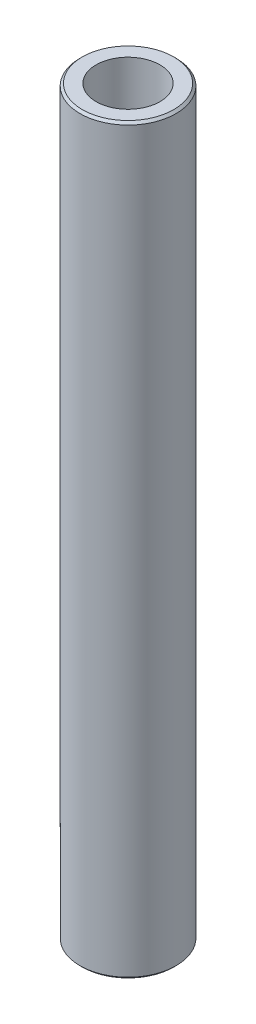
ISO-10303-21;
HEADER;
FILE_DESCRIPTION(('STEP AP214'),'2;1');
FILE_NAME('part.step','',(''),(''),'','','');
FILE_SCHEMA(('AUTOMOTIVE_DESIGN { 1 0 10303 214 1 1 1 1 }'));
ENDSEC;
DATA;
#1=APPLICATION_CONTEXT('core data for automotive mechanical design processes');
#2=APPLICATION_PROTOCOL_DEFINITION('international standard','automotive_design',2000,#1);
#3=PRODUCT_CONTEXT('',#1,'mechanical');
#4=PRODUCT('Part','Part','',(#3));
#5=PRODUCT_RELATED_PRODUCT_CATEGORY('part','',(#4));
#6=PRODUCT_DEFINITION_FORMATION('','',#4);
#7=PRODUCT_DEFINITION_CONTEXT('part definition',#1,'design');
#8=PRODUCT_DEFINITION('design','',#6,#7);
#9=PRODUCT_DEFINITION_SHAPE('','',#8);
#10=(LENGTH_UNIT() NAMED_UNIT(*) SI_UNIT(.MILLI.,.METRE.));
#11=(NAMED_UNIT(*) PLANE_ANGLE_UNIT() SI_UNIT($,.RADIAN.));
#12=(NAMED_UNIT(*) SI_UNIT($,.STERADIAN.) SOLID_ANGLE_UNIT());
#13=UNCERTAINTY_MEASURE_WITH_UNIT(LENGTH_MEASURE(1.E-05),#10,'distance_accuracy_value','');
#14=(GEOMETRIC_REPRESENTATION_CONTEXT(3) GLOBAL_UNCERTAINTY_ASSIGNED_CONTEXT((#13)) GLOBAL_UNIT_ASSIGNED_CONTEXT((#10,
#11,#12)) REPRESENTATION_CONTEXT('',''));
#15=CARTESIAN_POINT('',(0.,0.,0.));
#16=DIRECTION('',(0.,0.,1.));
#17=DIRECTION('',(1.,0.,0.));
#18=AXIS2_PLACEMENT_3D('',#15,#16,#17);
#19=CARTESIAN_POINT('',(0.,464.065258486996,0.));
#20=DIRECTION('',(0.,-1.,0.));
#21=DIRECTION('',(0.,0.,-1.));
#22=AXIS2_PLACEMENT_3D('',#19,#20,#21);
#23=CYLINDRICAL_SURFACE('',#22,30.);
#24=CARTESIAN_POINT('',(0.,462.625378410206,0.));
#25=DIRECTION('',(0.,1.,0.));
#26=DIRECTION('',(0.,0.,1.));
#27=AXIS2_PLACEMENT_3D('',#24,#25,#26);
#28=CIRCLE('',#27,30.);
#29=CARTESIAN_POINT('',(0.,462.625378410206,-30.));
#30=VERTEX_POINT('',#29);
#31=EDGE_CURVE('E50',#30,#30,#28,.F.);
#32=CARTESIAN_POINT('',(0.,1.43988007679019,0.));
#33=DIRECTION('',(0.,1.,0.));
#34=DIRECTION('',(0.,0.,1.));
#35=AXIS2_PLACEMENT_3D('',#32,#33,#34);
#36=CIRCLE('',#35,30.);
#37=CARTESIAN_POINT('',(0.,1.43988007679019,-30.));
#38=VERTEX_POINT('',#37);
#39=EDGE_CURVE('E51',#38,#38,#36,.T.);
#40=CARTESIAN_POINT('',(0.,462.625378410206,-30.));
#41=CARTESIAN_POINT('',(0.,457.821362802567,-30.));
#42=CARTESIAN_POINT('',(0.,453.017347194927,-30.));
#43=CARTESIAN_POINT('',(0.,443.409315979647,-30.));
#44=CARTESIAN_POINT('',(0.,438.605300372008,-30.));
#45=CARTESIAN_POINT('',(0.,428.997269156728,-30.));
#46=CARTESIAN_POINT('',(0.,424.193253549088,-30.));
#47=CARTESIAN_POINT('',(0.,414.585222333809,-30.));
#48=CARTESIAN_POINT('',(0.,409.781206726169,-30.));
#49=CARTESIAN_POINT('',(0.,400.17317551089,-30.));
#50=CARTESIAN_POINT('',(0.,395.36915990325,-30.));
#51=CARTESIAN_POINT('',(0.,385.76112868797,-30.));
#52=CARTESIAN_POINT('',(0.,380.957113080331,-30.));
#53=CARTESIAN_POINT('',(0.,371.349081865051,-30.));
#54=CARTESIAN_POINT('',(0.,366.545066257411,-30.));
#55=CARTESIAN_POINT('',(0.,356.937035042132,-30.));
#56=CARTESIAN_POINT('',(0.,352.133019434492,-30.));
#57=CARTESIAN_POINT('',(0.,342.524988219213,-30.));
#58=CARTESIAN_POINT('',(0.,337.720972611573,-30.));
#59=CARTESIAN_POINT('',(0.,328.112941396293,-30.));
#60=CARTESIAN_POINT('',(0.,323.308925788654,-30.));
#61=CARTESIAN_POINT('',(0.,313.700894573374,-30.));
#62=CARTESIAN_POINT('',(0.,308.896878965734,-30.));
#63=CARTESIAN_POINT('',(0.,299.288847750455,-30.));
#64=CARTESIAN_POINT('',(0.,294.484832142815,-30.));
#65=CARTESIAN_POINT('',(0.,284.876800927536,-30.));
#66=CARTESIAN_POINT('',(0.,280.072785319896,-30.));
#67=CARTESIAN_POINT('',(0.,270.464754104616,-30.));
#68=CARTESIAN_POINT('',(0.,265.660738496977,-30.));
#69=CARTESIAN_POINT('',(0.,256.052707281697,-30.));
#70=CARTESIAN_POINT('',(0.,251.248691674057,-30.));
#71=CARTESIAN_POINT('',(0.,241.640660458778,-30.));
#72=CARTESIAN_POINT('',(0.,236.836644851138,-30.));
#73=CARTESIAN_POINT('',(0.,227.228613635859,-30.));
#74=CARTESIAN_POINT('',(0.,222.424598028219,-30.));
#75=CARTESIAN_POINT('',(0.,212.816566812939,-30.));
#76=CARTESIAN_POINT('',(0.,208.0125512053,-30.));
#77=CARTESIAN_POINT('',(0.,198.40451999002,-30.));
#78=CARTESIAN_POINT('',(0.,193.60050438238,-30.));
#79=CARTESIAN_POINT('',(0.,183.992473167101,-30.));
#80=CARTESIAN_POINT('',(0.,179.188457559461,-30.));
#81=CARTESIAN_POINT('',(0.,169.580426344181,-30.));
#82=CARTESIAN_POINT('',(0.,164.776410736542,-30.));
#83=CARTESIAN_POINT('',(0.,155.168379521262,-30.));
#84=CARTESIAN_POINT('',(0.,150.364363913623,-30.));
#85=CARTESIAN_POINT('',(0.,140.756332698343,-30.));
#86=CARTESIAN_POINT('',(0.,135.952317090703,-30.));
#87=CARTESIAN_POINT('',(0.,126.344285875424,-30.));
#88=CARTESIAN_POINT('',(0.,121.540270267784,-30.));
#89=CARTESIAN_POINT('',(0.,111.932239052504,-30.));
#90=CARTESIAN_POINT('',(0.,107.128223444865,-30.));
#91=CARTESIAN_POINT('',(0.,97.5201922295852,-30.));
#92=CARTESIAN_POINT('',(0.,92.7161766219455,-30.));
#93=CARTESIAN_POINT('',(0.,83.108145406666,-30.));
#94=CARTESIAN_POINT('',(0.,78.3041297990262,-30.));
#95=CARTESIAN_POINT('',(0.,68.6960985837467,-30.));
#96=CARTESIAN_POINT('',(0.,63.8920829761069,-30.));
#97=CARTESIAN_POINT('',(0.,54.2840517608274,-30.));
#98=CARTESIAN_POINT('',(0.,49.4800361531877,-30.));
#99=CARTESIAN_POINT('',(0.,39.8720049379082,-30.));
#100=CARTESIAN_POINT('',(0.,35.0679893302684,-30.));
#101=CARTESIAN_POINT('',(0.,25.4599581149889,-30.));
#102=CARTESIAN_POINT('',(0.,20.6559425073491,-30.));
#103=CARTESIAN_POINT('',(0.,11.0479112920696,-30.));
#104=CARTESIAN_POINT('',(0.,6.24389568442992,-30.));
#105=CARTESIAN_POINT('',(0.,1.43988007679019,-30.));
#106=B_SPLINE_CURVE_WITH_KNOTS('',3,(#40,#41,#42,#43,#44,#45,#46,#47,#48,#49,#50,#51,#52,#53,
#54,#55,#56,#57,#58,#59,#60,#61,#62,#63,#64,#65,#66,#67,#68,#69,#70,#71,#72,#73,#74,#75,#76,#77,
#78,#79,#80,#81,#82,#83,#84,#85,#86,#87,#88,#89,#90,#91,#92,#93,#94,#95,#96,#97,#98,#99,#100,
#101,#102,#103,#104,#105),.UNSPECIFIED.,.F.,.F.,(4,2,2,2,2,2,2,2,2,2,2,2,2,2,2,2,2,2,2,2,2,2,2,
2,2,2,2,2,2,2,2,2,4),(0.,14.4120468229193,28.8240936458385,43.2361404687578,57.648187291677,
72.0602341145963,86.4722809375156,100.884327760435,115.296374583354,129.708421406273,
144.120468229193,158.532515052112,172.944561875031,187.35660869795,201.76865552087,
216.180702343789,230.592749166708,245.004795989627,259.416842812547,273.828889635466,
288.240936458385,302.652983281304,317.065030104224,331.477076927143,345.889123750062,
360.301170572981,374.713217395901,389.12526421882,403.537311041739,417.949357864658,
432.361404687578,446.773451510497,461.185498333416),.UNSPECIFIED.);
#107=EDGE_CURVE('BSEAM39',#30,#38,#106,.T.);
#108=ORIENTED_EDGE('',*,*,#31,.T.);
#109=ORIENTED_EDGE('',*,*,#39,.T.);
#110=ORIENTED_EDGE('',*,*,#107,.T.);
#111=ORIENTED_EDGE('',*,*,#107,.F.);
#112=EDGE_LOOP('',(#108,#110,#109,#111));
#113=FACE_BOUND('',#112,.T.);
#114=ADVANCED_FACE('F39',(#113),#23,.T.);
#115=CARTESIAN_POINT('',(0.,464.065258486996,0.));
#116=DIRECTION('',(0.,1.,0.));
#117=DIRECTION('',(0.,0.,1.));
#118=AXIS2_PLACEMENT_3D('',#115,#116,#117);
#119=PLANE('',#118);
#120=CARTESIAN_POINT('',(0.,464.065258486996,0.));
#121=DIRECTION('',(0.,1.,0.));
#122=DIRECTION('',(0.,0.,1.));
#123=AXIS2_PLACEMENT_3D('',#120,#121,#122);
#124=CIRCLE('',#123,28.5601199232104);
#125=CARTESIAN_POINT('',(0.,464.065258486996,28.5601199232104));
#126=VERTEX_POINT('',#125);
#127=EDGE_CURVE('E54',#126,#126,#124,.T.);
#128=ORIENTED_EDGE('',*,*,#127,.T.);
#129=EDGE_LOOP('',(#128));
#130=FACE_BOUND('',#129,.T.);
#131=CARTESIAN_POINT('',(0.,464.065258486996,0.));
#132=DIRECTION('',(0.,1.,0.));
#133=DIRECTION('',(0.,0.,1.));
#134=AXIS2_PLACEMENT_3D('',#131,#132,#133);
#135=CIRCLE('',#134,19.9633125557239);
#136=CARTESIAN_POINT('',(0.,464.065258486996,-19.9633125557239));
#137=VERTEX_POINT('',#136);
#138=EDGE_CURVE('E58',#137,#137,#135,.T.);
#139=ORIENTED_EDGE('',*,*,#138,.F.);
#140=EDGE_LOOP('',(#139));
#141=FACE_BOUND('',#140,.T.);
#142=ADVANCED_FACE('F69',(#130,#141),#119,.T.);
#143=CARTESIAN_POINT('',(0.,0.,0.));
#144=DIRECTION('',(0.,1.,0.));
#145=DIRECTION('',(0.,0.,1.));
#146=AXIS2_PLACEMENT_3D('',#143,#144,#145);
#147=PLANE('',#146);
#148=CARTESIAN_POINT('',(0.,0.,0.));
#149=DIRECTION('',(0.,1.,0.));
#150=DIRECTION('',(0.,0.,1.));
#151=AXIS2_PLACEMENT_3D('',#148,#149,#150);
#152=CIRCLE('',#151,28.5601199232098);
#153=CARTESIAN_POINT('',(0.,0.,28.5601199232098));
#154=VERTEX_POINT('',#153);
#155=EDGE_CURVE('E10',#154,#154,#152,.F.);
#156=ORIENTED_EDGE('',*,*,#155,.T.);
#157=EDGE_LOOP('',(#156));
#158=FACE_BOUND('',#157,.T.);
#159=CARTESIAN_POINT('',(0.,0.,0.));
#160=DIRECTION('',(0.,1.,0.));
#161=DIRECTION('',(0.,0.,1.));
#162=AXIS2_PLACEMENT_3D('',#159,#160,#161);
#163=CIRCLE('',#162,19.9633125557239);
#164=CARTESIAN_POINT('',(0.,0.,-19.9633125557239));
#165=VERTEX_POINT('',#164);
#166=EDGE_CURVE('E63',#165,#165,#163,.T.);
#167=ORIENTED_EDGE('',*,*,#166,.T.);
#168=EDGE_LOOP('',(#167));
#169=FACE_BOUND('',#168,.T.);
#170=ADVANCED_FACE('F75',(#158,#169),#147,.F.);
#171=CARTESIAN_POINT('',(0.,464.065258486996,0.));
#172=DIRECTION('',(0.,-1.,0.));
#173=DIRECTION('',(0.,0.,-1.));
#174=AXIS2_PLACEMENT_3D('',#171,#172,#173);
#175=CYLINDRICAL_SURFACE('',#174,19.9633125557239);
#176=CARTESIAN_POINT('',(0.,464.065258486996,-19.9633125557239));
#177=CARTESIAN_POINT('',(0.,459.231245377756,-19.9633125557239));
#178=CARTESIAN_POINT('',(0.,454.397232268517,-19.9633125557239));
#179=CARTESIAN_POINT('',(0.,444.729206050038,-19.9633125557239));
#180=CARTESIAN_POINT('',(0.,439.895192940798,-19.9633125557239));
#181=CARTESIAN_POINT('',(0.,430.227166722319,-19.9633125557239));
#182=CARTESIAN_POINT('',(0.,425.39315361308,-19.9633125557239));
#183=CARTESIAN_POINT('',(0.,415.7251273946,-19.9633125557239));
#184=CARTESIAN_POINT('',(0.,410.891114285361,-19.9633125557239));
#185=CARTESIAN_POINT('',(0.,401.223088066882,-19.9633125557239));
#186=CARTESIAN_POINT('',(0.,396.389074957642,-19.9633125557239));
#187=CARTESIAN_POINT('',(0.,386.721048739163,-19.9633125557239));
#188=CARTESIAN_POINT('',(0.,381.887035629924,-19.9633125557239));
#189=CARTESIAN_POINT('',(0.,372.219009411445,-19.9633125557239));
#190=CARTESIAN_POINT('',(0.,367.384996302205,-19.9633125557239));
#191=CARTESIAN_POINT('',(0.,357.716970083726,-19.9633125557239));
#192=CARTESIAN_POINT('',(0.,352.882956974486,-19.9633125557239));
#193=CARTESIAN_POINT('',(0.,343.214930756007,-19.9633125557239));
#194=CARTESIAN_POINT('',(0.,338.380917646768,-19.9633125557239));
#195=CARTESIAN_POINT('',(0.,328.712891428289,-19.9633125557239));
#196=CARTESIAN_POINT('',(0.,323.878878319049,-19.9633125557239));
#197=CARTESIAN_POINT('',(0.,314.21085210057,-19.9633125557239));
#198=CARTESIAN_POINT('',(0.,309.376838991331,-19.9633125557239));
#199=CARTESIAN_POINT('',(0.,299.708812772852,-19.9633125557239));
#200=CARTESIAN_POINT('',(0.,294.874799663612,-19.9633125557239));
#201=CARTESIAN_POINT('',(0.,285.206773445133,-19.9633125557239));
#202=CARTESIAN_POINT('',(0.,280.372760335893,-19.9633125557239));
#203=CARTESIAN_POINT('',(0.,270.704734117414,-19.9633125557239));
#204=CARTESIAN_POINT('',(0.,265.870721008175,-19.9633125557239));
#205=CARTESIAN_POINT('',(0.,256.202694789696,-19.9633125557239));
#206=CARTESIAN_POINT('',(0.,251.368681680456,-19.9633125557239));
#207=CARTESIAN_POINT('',(0.,241.700655461977,-19.9633125557239));
#208=CARTESIAN_POINT('',(0.,236.866642352737,-19.9633125557239));
#209=CARTESIAN_POINT('',(0.,227.198616134258,-19.9633125557239));
#210=CARTESIAN_POINT('',(0.,222.364603025019,-19.9633125557239));
#211=CARTESIAN_POINT('',(0.,212.69657680654,-19.9633125557239));
#212=CARTESIAN_POINT('',(0.,207.8625636973,-19.9633125557239));
#213=CARTESIAN_POINT('',(0.,198.194537478821,-19.9633125557239));
#214=CARTESIAN_POINT('',(0.,193.360524369582,-19.9633125557239));
#215=CARTESIAN_POINT('',(0.,183.692498151103,-19.9633125557239));
#216=CARTESIAN_POINT('',(0.,178.858485041863,-19.9633125557239));
#217=CARTESIAN_POINT('',(0.,169.190458823384,-19.9633125557239));
#218=CARTESIAN_POINT('',(0.,164.356445714144,-19.9633125557239));
#219=CARTESIAN_POINT('',(0.,154.688419495665,-19.9633125557239));
#220=CARTESIAN_POINT('',(0.,149.854406386426,-19.9633125557239));
#221=CARTESIAN_POINT('',(0.,140.186380167947,-19.9633125557239));
#222=CARTESIAN_POINT('',(0.,135.352367058707,-19.9633125557239));
#223=CARTESIAN_POINT('',(0.,125.684340840228,-19.9633125557239));
#224=CARTESIAN_POINT('',(0.,120.850327730989,-19.9633125557239));
#225=CARTESIAN_POINT('',(0.,111.182301512509,-19.9633125557239));
#226=CARTESIAN_POINT('',(0.,106.34828840327,-19.9633125557239));
#227=CARTESIAN_POINT('',(0.,96.6802621847908,-19.9633125557239));
#228=CARTESIAN_POINT('',(0.,91.8462490755513,-19.9633125557239));
#229=CARTESIAN_POINT('',(0.,82.1782228570722,-19.9633125557239));
#230=CARTESIAN_POINT('',(0.,77.3442097478327,-19.9633125557239));
#231=CARTESIAN_POINT('',(0.,67.6761835293536,-19.9633125557239));
#232=CARTESIAN_POINT('',(0.,62.842170420114,-19.9633125557239));
#233=CARTESIAN_POINT('',(0.,53.1741442016349,-19.9633125557239));
#234=CARTESIAN_POINT('',(0.,48.3401310923954,-19.9633125557239));
#235=CARTESIAN_POINT('',(0.,38.6721048739163,-19.9633125557239));
#236=CARTESIAN_POINT('',(0.,33.8380917646768,-19.9633125557239));
#237=CARTESIAN_POINT('',(0.,24.1700655461977,-19.9633125557239));
#238=CARTESIAN_POINT('',(0.,19.3360524369582,-19.9633125557239));
#239=CARTESIAN_POINT('',(0.,9.66802621847911,-19.9633125557239));
#240=CARTESIAN_POINT('',(0.,4.83401310923956,-19.9633125557239));
#241=CARTESIAN_POINT('',(0.,0.,-19.9633125557239));
#242=B_SPLINE_CURVE_WITH_KNOTS('',3,(#176,#177,#178,#179,#180,#181,#182,#183,#184,#185,#186,
#187,#188,#189,#190,#191,#192,#193,#194,#195,#196,#197,#198,#199,#200,#201,#202,#203,#204,#205,
#206,#207,#208,#209,#210,#211,#212,#213,#214,#215,#216,#217,#218,#219,#220,#221,#222,#223,#224,
#225,#226,#227,#228,#229,#230,#231,#232,#233,#234,#235,#236,#237,#238,#239,#240,#241),
.UNSPECIFIED.,.F.,.F.,(4,2,2,2,2,2,2,2,2,2,2,2,2,2,2,2,2,2,2,2,2,2,2,2,2,2,2,2,2,2,2,2,4),(0.,
14.5020393277187,29.0040786554372,43.5061179831559,58.0081573108745,72.5101966385931,
87.0122359663117,101.51427529403,116.016314621749,130.518353949468,145.020393277186,
159.522432604905,174.024471932623,188.526511260342,203.028550588061,217.530589915779,
232.032629243498,246.534668571217,261.036707898935,275.538747226654,290.040786554372,
304.542825882091,319.04486520981,333.546904537528,348.048943865247,362.550983192966,
377.053022520684,391.555061848403,406.057101176121,420.55914050384,435.061179831559,
449.563219159277,464.065258486996),.UNSPECIFIED.);
#243=EDGE_CURVE('BSEAM70',#137,#165,#242,.T.);
#244=ORIENTED_EDGE('',*,*,#138,.T.);
#245=ORIENTED_EDGE('',*,*,#166,.F.);
#246=ORIENTED_EDGE('',*,*,#243,.T.);
#247=ORIENTED_EDGE('',*,*,#243,.F.);
#248=EDGE_LOOP('',(#244,#246,#245,#247));
#249=FACE_BOUND('',#248,.T.);
#250=ADVANCED_FACE('F70',(#249),#175,.F.);
#251=CARTESIAN_POINT('',(0.,464.065258486996,0.));
#252=DIRECTION('',(0.,-1.,0.));
#253=DIRECTION('',(0.,0.,-1.));
#254=AXIS2_PLACEMENT_3D('',#251,#252,#253);
#255=CONICAL_SURFACE('',#254,28.5601199232104,0.785398163397459);
#256=ORIENTED_EDGE('',*,*,#31,.F.);
#257=EDGE_LOOP('',(#256));
#258=FACE_BOUND('',#257,.T.);
#259=ORIENTED_EDGE('',*,*,#127,.F.);
#260=EDGE_LOOP('',(#259));
#261=FACE_BOUND('',#260,.T.);
#262=ADVANCED_FACE('F81',(#258,#261),#255,.T.);
#263=CARTESIAN_POINT('',(0.,1.43988007679019,0.));
#264=DIRECTION('',(0.,1.,0.));
#265=DIRECTION('',(0.,0.,1.));
#266=AXIS2_PLACEMENT_3D('',#263,#264,#265);
#267=CONICAL_SURFACE('',#266,30.,0.78539816339746);
#268=ORIENTED_EDGE('',*,*,#155,.F.);
#269=EDGE_LOOP('',(#268));
#270=FACE_BOUND('',#269,.T.);
#271=ORIENTED_EDGE('',*,*,#39,.F.);
#272=EDGE_LOOP('',(#271));
#273=FACE_BOUND('',#272,.T.);
#274=ADVANCED_FACE('F45',(#270,#273),#267,.T.);
#275=CLOSED_SHELL('',(#114,#142,#170,#250,#262,#274));
#276=MANIFOLD_SOLID_BREP('B2',#275);
#277=ADVANCED_BREP_SHAPE_REPRESENTATION('',(#18,#276),#14);
#278=SHAPE_DEFINITION_REPRESENTATION(#9,#277);
ENDSEC;
END-ISO-10303-21;
